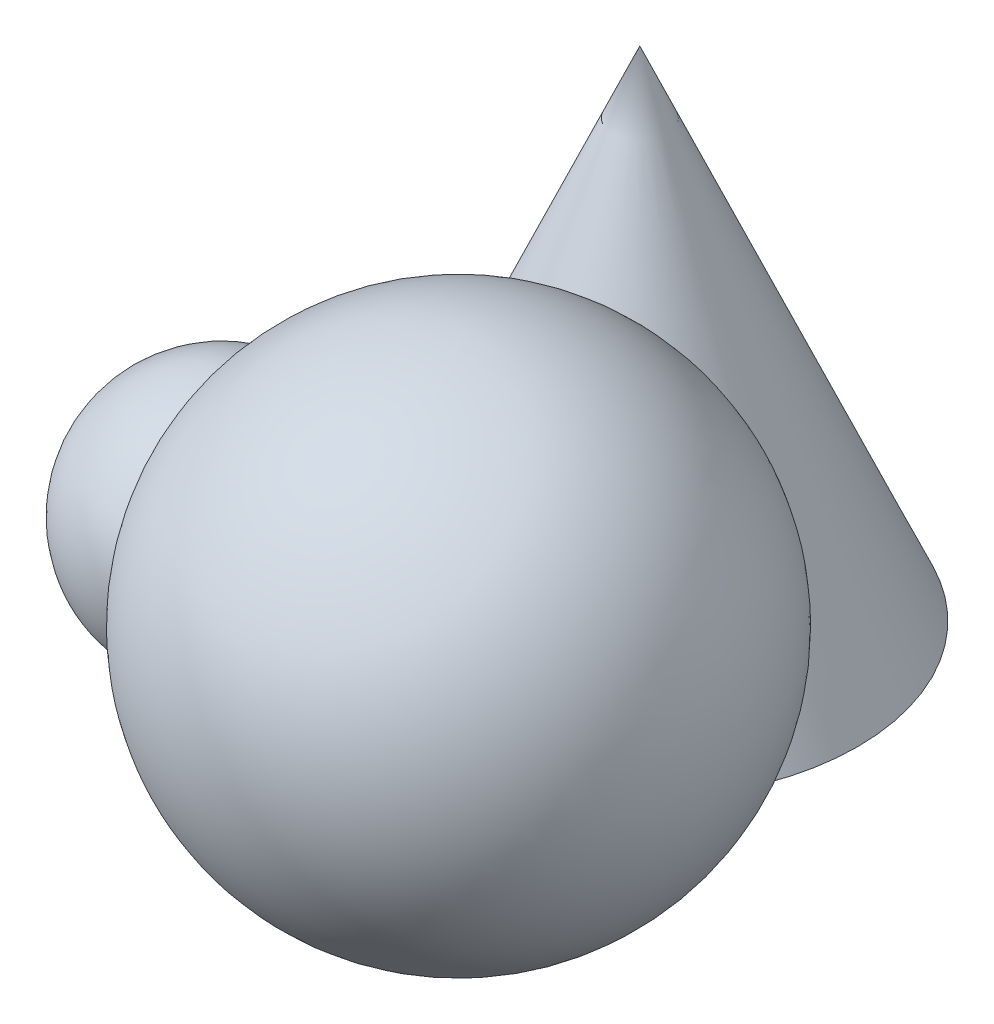
ISO-10303-21;
HEADER;
FILE_DESCRIPTION(('STEP AP214'),'2;1');
FILE_NAME('part.step','',(''),(''),'','','');
FILE_SCHEMA(('AUTOMOTIVE_DESIGN { 1 0 10303 214 1 1 1 1 }'));
ENDSEC;
DATA;
#1=APPLICATION_CONTEXT('core data for automotive mechanical design processes');
#2=APPLICATION_PROTOCOL_DEFINITION('international standard','automotive_design',2000,#1);
#3=PRODUCT_CONTEXT('',#1,'mechanical');
#4=PRODUCT('Part','Part','',(#3));
#5=PRODUCT_RELATED_PRODUCT_CATEGORY('part','',(#4));
#6=PRODUCT_DEFINITION_FORMATION('','',#4);
#7=PRODUCT_DEFINITION_CONTEXT('part definition',#1,'design');
#8=PRODUCT_DEFINITION('design','',#6,#7);
#9=PRODUCT_DEFINITION_SHAPE('','',#8);
#10=(LENGTH_UNIT() NAMED_UNIT(*) SI_UNIT(.MILLI.,.METRE.));
#11=(NAMED_UNIT(*) PLANE_ANGLE_UNIT() SI_UNIT($,.RADIAN.));
#12=(NAMED_UNIT(*) SI_UNIT($,.STERADIAN.) SOLID_ANGLE_UNIT());
#13=UNCERTAINTY_MEASURE_WITH_UNIT(LENGTH_MEASURE(1.E-05),#10,'distance_accuracy_value','');
#14=(GEOMETRIC_REPRESENTATION_CONTEXT(3) GLOBAL_UNCERTAINTY_ASSIGNED_CONTEXT((#13)) GLOBAL_UNIT_ASSIGNED_CONTEXT((#10,
#11,#12)) REPRESENTATION_CONTEXT('',''));
#15=CARTESIAN_POINT('',(0.,0.,0.));
#16=DIRECTION('',(0.,0.,1.));
#17=DIRECTION('',(1.,0.,0.));
#18=AXIS2_PLACEMENT_3D('',#15,#16,#17);
#19=CARTESIAN_POINT('',(-28.0324830732296,20.,39.0627219516792));
#20=DIRECTION('',(0.,0.,1.));
#21=DIRECTION('',(-1.,0.,0.));
#22=AXIS2_PLACEMENT_3D('',#19,#20,#21);
#23=SPHERICAL_SURFACE('',#22,20.);
#24=CARTESIAN_POINT('',(-28.0324830732296,20.,59.0627219516792));
#25=VERTEX_POINT('',#24);
#26=VERTEX_LOOP('',#25);
#27=FACE_BOUND('',#26,.T.);
#28=ADVANCED_FACE('F38',(#27),#23,.T.);
#29=CLOSED_SHELL('',(#28));
#30=MANIFOLD_SOLID_BREP('B2',#29);
#31=CARTESIAN_POINT('',(26.1606229914325,40.,55.2833031701279));
#32=DIRECTION('',(0.,0.,-1.));
#33=DIRECTION('',(1.,0.,0.));
#34=AXIS2_PLACEMENT_3D('',#31,#32,#33);
#35=SPHERICAL_SURFACE('',#34,40.);
#36=CARTESIAN_POINT('',(-9.96811438500889,26.6666666666667,44.4695823578288));
#37=VERTEX_POINT('',#36);
#38=VERTEX_LOOP('',#37);
#39=FACE_BOUND('',#38,.T.);
#40=ADVANCED_FACE('F60',(#39),#35,.T.);
#41=CLOSED_SHELL('',(#40));
#42=MANIFOLD_SOLID_BREP('B6',#41);
#43=CARTESIAN_POINT('',(0.,0.,0.));
#44=DIRECTION('',(0.,1.,0.));
#45=DIRECTION('',(-1.,0.,0.));
#46=AXIS2_PLACEMENT_3D('',#43,#44,#45);
#47=PLANE('',#46);
#48=CARTESIAN_POINT('',(0.,0.,0.));
#49=DIRECTION('',(0.,1.,0.));
#50=DIRECTION('',(-1.,0.,0.));
#51=AXIS2_PLACEMENT_3D('',#48,#49,#50);
#52=CIRCLE('',#51,35.);
#53=CARTESIAN_POINT('',(-35.,0.,0.));
#54=VERTEX_POINT('',#53);
#55=EDGE_CURVE('E58',#54,#54,#52,.T.);
#56=ORIENTED_EDGE('',*,*,#55,.F.);
#57=EDGE_LOOP('',(#56));
#58=FACE_BOUND('',#57,.T.);
#59=ADVANCED_FACE('F73',(#58),#47,.F.);
#60=CARTESIAN_POINT('',(0.,0.,0.));
#61=DIRECTION('',(0.,-1.,0.));
#62=DIRECTION('',(1.,0.,0.));
#63=AXIS2_PLACEMENT_3D('',#60,#61,#62);
#64=CONICAL_SURFACE('',#63,35.,0.412410441597387);
#65=CARTESIAN_POINT('',(-17.3494553705705,11.9836233196058,24.1761298627472));
#66=VERTEX_POINT('',#65);
#67=VERTEX_LOOP('',#66);
#68=FACE_BOUND('',#67,.T.);
#69=CARTESIAN_POINT('',(10.4856704046551,23.9672466392117,22.1585891174087));
#70=VERTEX_POINT('',#69);
#71=VERTEX_LOOP('',#70);
#72=FACE_BOUND('',#71,.T.);
#73=CARTESIAN_POINT('',(0.,80.,0.));
#74=VERTEX_POINT('',#73);
#75=VERTEX_LOOP('',#74);
#76=FACE_BOUND('',#75,.T.);
#77=ORIENTED_EDGE('',*,*,#55,.T.);
#78=EDGE_LOOP('',(#77));
#79=FACE_BOUND('',#78,.T.);
#80=ADVANCED_FACE('F88',(#68,#72,#76,#79),#64,.T.);
#81=CLOSED_SHELL('',(#59,#80));
#82=MANIFOLD_SOLID_BREP('B32',#81);
#83=ADVANCED_BREP_SHAPE_REPRESENTATION('',(#18,#30,#42,#82),#14);
#84=SHAPE_DEFINITION_REPRESENTATION(#9,#83);
ENDSEC;
END-ISO-10303-21;
